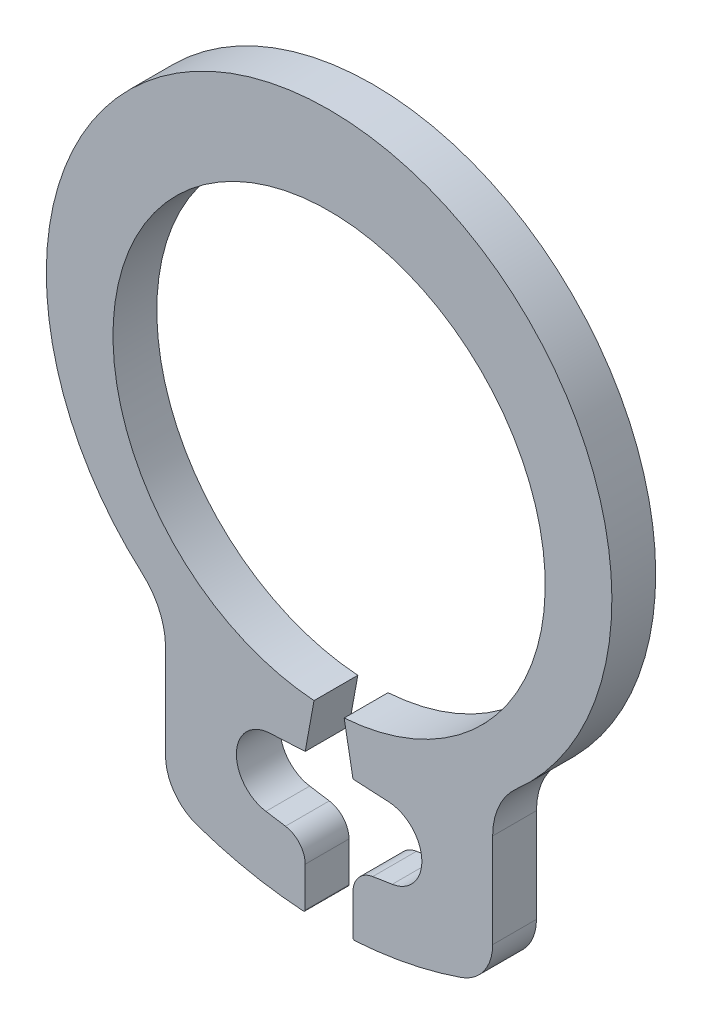
ISO-10303-21;
HEADER;
FILE_DESCRIPTION(('STEP AP214'),'2;1');
FILE_NAME('part.step','',(''),(''),'','','');
FILE_SCHEMA(('AUTOMOTIVE_DESIGN { 1 0 10303 214 1 1 1 1 }'));
ENDSEC;
DATA;
#1=APPLICATION_CONTEXT('core data for automotive mechanical design processes');
#2=APPLICATION_PROTOCOL_DEFINITION('international standard','automotive_design',2000,#1);
#3=PRODUCT_CONTEXT('',#1,'mechanical');
#4=PRODUCT('Part','Part','',(#3));
#5=PRODUCT_RELATED_PRODUCT_CATEGORY('part','',(#4));
#6=PRODUCT_DEFINITION_FORMATION('','',#4);
#7=PRODUCT_DEFINITION_CONTEXT('part definition',#1,'design');
#8=PRODUCT_DEFINITION('design','',#6,#7);
#9=PRODUCT_DEFINITION_SHAPE('','',#8);
#10=(LENGTH_UNIT() NAMED_UNIT(*) SI_UNIT(.MILLI.,.METRE.));
#11=(NAMED_UNIT(*) PLANE_ANGLE_UNIT() SI_UNIT($,.RADIAN.));
#12=(NAMED_UNIT(*) SI_UNIT($,.STERADIAN.) SOLID_ANGLE_UNIT());
#13=UNCERTAINTY_MEASURE_WITH_UNIT(LENGTH_MEASURE(1.E-05),#10,'distance_accuracy_value','');
#14=(GEOMETRIC_REPRESENTATION_CONTEXT(3) GLOBAL_UNCERTAINTY_ASSIGNED_CONTEXT((#13)) GLOBAL_UNIT_ASSIGNED_CONTEXT((#10,
#11,#12)) REPRESENTATION_CONTEXT('',''));
#15=CARTESIAN_POINT('',(0.,0.,0.));
#16=DIRECTION('',(0.,0.,1.));
#17=DIRECTION('',(1.,0.,0.));
#18=AXIS2_PLACEMENT_3D('',#15,#16,#17);
#19=CARTESIAN_POINT('',(0.,0.358532333118166,0.375));
#20=DIRECTION('',(0.,0.,-1.));
#21=DIRECTION('',(-1.,0.,0.));
#22=AXIS2_PLACEMENT_3D('',#19,#20,#21);
#23=CYLINDRICAL_SURFACE('',#22,4.84146766688184);
#24=CARTESIAN_POINT('',(0.,0.358532333118166,-0.375));
#25=DIRECTION('',(0.,0.,1.));
#26=DIRECTION('',(1.,0.,0.));
#27=AXIS2_PLACEMENT_3D('',#24,#25,#26);
#28=CIRCLE('',#27,4.84146766688184);
#29=CARTESIAN_POINT('',(3.20560494235103,-3.2696774352162,-0.375));
#30=VERTEX_POINT('',#29);
#31=CARTESIAN_POINT('',(-3.20560494235102,-3.26967743521621,-0.375));
#32=VERTEX_POINT('',#31);
#33=EDGE_CURVE('E159',#30,#32,#28,.T.);
#34=ORIENTED_EDGE('',*,*,#33,.T.);
#35=DIRECTION('',(0.,0.,-1.));
#36=VECTOR('',#35,1.);
#37=CARTESIAN_POINT('',(-3.20560494235102,-3.26967743521621,0.375));
#38=LINE('',#37,#36);
#39=CARTESIAN_POINT('',(-3.20560494235102,-3.26967743521621,0.375));
#40=VERTEX_POINT('',#39);
#41=EDGE_CURVE('E11',#40,#32,#38,.T.);
#42=ORIENTED_EDGE('',*,*,#41,.F.);
#43=CARTESIAN_POINT('',(0.,0.358532333118166,0.375));
#44=DIRECTION('',(0.,0.,1.));
#45=DIRECTION('',(1.,0.,0.));
#46=AXIS2_PLACEMENT_3D('',#43,#44,#45);
#47=CIRCLE('',#46,4.84146766688184);
#48=CARTESIAN_POINT('',(3.20560494235103,-3.2696774352162,0.375));
#49=VERTEX_POINT('',#48);
#50=EDGE_CURVE('E185',#49,#40,#47,.T.);
#51=ORIENTED_EDGE('',*,*,#50,.F.);
#52=DIRECTION('',(0.,0.,-1.));
#53=VECTOR('',#52,1.);
#54=CARTESIAN_POINT('',(3.20560494235103,-3.2696774352162,0.375));
#55=LINE('',#54,#53);
#56=EDGE_CURVE('E163',#49,#30,#55,.T.);
#57=ORIENTED_EDGE('',*,*,#56,.T.);
#58=EDGE_LOOP('',(#34,#42,#51,#57));
#59=FACE_BOUND('',#58,.T.);
#60=ADVANCED_FACE('F32',(#59),#23,.T.);
#61=CARTESIAN_POINT('',(-4.00014209420165,-4.16896088014838,0.375));
#62=DIRECTION('',(0.,0.,-1.));
#63=DIRECTION('',(-1.,0.,0.));
#64=AXIS2_PLACEMENT_3D('',#61,#62,#63);
#65=CYLINDRICAL_SURFACE('',#64,1.2);
#66=CARTESIAN_POINT('',(-4.00014209420165,-4.16896088014838,-0.375));
#67=DIRECTION('',(0.,0.,-1.));
#68=DIRECTION('',(-1.,0.,0.));
#69=AXIS2_PLACEMENT_3D('',#66,#67,#68);
#70=CIRCLE('',#69,1.2);
#71=CARTESIAN_POINT('',(-2.80014209420166,-4.16896088014838,-0.375));
#72=VERTEX_POINT('',#71);
#73=EDGE_CURVE('E162',#32,#72,#70,.T.);
#74=ORIENTED_EDGE('',*,*,#73,.T.);
#75=DIRECTION('',(0.,0.,-1.));
#76=VECTOR('',#75,1.);
#77=CARTESIAN_POINT('',(-2.80014209420166,-4.16896088014838,0.375));
#78=LINE('',#77,#76);
#79=CARTESIAN_POINT('',(-2.80014209420166,-4.16896088014838,0.375));
#80=VERTEX_POINT('',#79);
#81=EDGE_CURVE('E40',#80,#72,#78,.T.);
#82=ORIENTED_EDGE('',*,*,#81,.F.);
#83=CARTESIAN_POINT('',(-4.00014209420165,-4.16896088014838,0.375));
#84=DIRECTION('',(0.,0.,-1.));
#85=DIRECTION('',(-1.,0.,0.));
#86=AXIS2_PLACEMENT_3D('',#83,#84,#85);
#87=CIRCLE('',#86,1.2);
#88=EDGE_CURVE('E104',#40,#80,#87,.T.);
#89=ORIENTED_EDGE('',*,*,#88,.F.);
#90=ORIENTED_EDGE('',*,*,#41,.T.);
#91=EDGE_LOOP('',(#74,#82,#89,#90));
#92=FACE_BOUND('',#91,.T.);
#93=ADVANCED_FACE('F315',(#92),#65,.F.);
#94=CARTESIAN_POINT('',(-2.80014209420165,-5.78059464722595,0.375));
#95=DIRECTION('',(1.,0.,0.));
#96=DIRECTION('',(0.,1.,0.));
#97=AXIS2_PLACEMENT_3D('',#94,#95,#96);
#98=PLANE('',#97);
#99=DIRECTION('',(0.,-1.,0.));
#100=VECTOR('',#99,1.);
#101=CARTESIAN_POINT('',(-2.80014209420165,-5.78059464722595,-0.375));
#102=LINE('',#101,#100);
#103=CARTESIAN_POINT('',(-2.80014209420166,-5.78059464722595,-0.375));
#104=VERTEX_POINT('',#103);
#105=EDGE_CURVE('E165',#72,#104,#102,.T.);
#106=ORIENTED_EDGE('',*,*,#105,.T.);
#107=DIRECTION('',(0.,0.,-1.));
#108=VECTOR('',#107,1.);
#109=CARTESIAN_POINT('',(-2.80014209420166,-5.78059464722595,0.375));
#110=LINE('',#109,#108);
#111=CARTESIAN_POINT('',(-2.80014209420166,-5.78059464722595,0.375));
#112=VERTEX_POINT('',#111);
#113=EDGE_CURVE('E204',#112,#104,#110,.T.);
#114=ORIENTED_EDGE('',*,*,#113,.F.);
#115=DIRECTION('',(0.,-1.,0.));
#116=VECTOR('',#115,1.);
#117=CARTESIAN_POINT('',(-2.80014209420165,-5.78059464722595,0.375));
#118=LINE('',#117,#116);
#119=EDGE_CURVE('E212',#80,#112,#118,.T.);
#120=ORIENTED_EDGE('',*,*,#119,.F.);
#121=ORIENTED_EDGE('',*,*,#81,.T.);
#122=EDGE_LOOP('',(#106,#114,#120,#121));
#123=FACE_BOUND('',#122,.T.);
#124=ADVANCED_FACE('F210',(#123),#98,.F.);
#125=CARTESIAN_POINT('',(-2.00014209420166,-5.78059464722595,0.375));
#126=DIRECTION('',(0.,0.,-1.));
#127=DIRECTION('',(-1.,0.,0.));
#128=AXIS2_PLACEMENT_3D('',#125,#126,#127);
#129=CYLINDRICAL_SURFACE('',#128,0.799999999999999);
#130=CARTESIAN_POINT('',(-2.00014209420166,-5.78059464722595,-0.375));
#131=DIRECTION('',(0.,0.,1.));
#132=DIRECTION('',(1.,0.,0.));
#133=AXIS2_PLACEMENT_3D('',#130,#131,#132);
#134=CIRCLE('',#133,0.799999999999999);
#135=CARTESIAN_POINT('',(-2.2617332582225,-6.53661717526742,-0.375));
#136=VERTEX_POINT('',#135);
#137=EDGE_CURVE('E167',#104,#136,#134,.T.);
#138=ORIENTED_EDGE('',*,*,#137,.T.);
#139=DIRECTION('',(0.,0.,-1.));
#140=VECTOR('',#139,1.);
#141=CARTESIAN_POINT('',(-2.2617332582225,-6.53661717526742,0.375));
#142=LINE('',#141,#140);
#143=CARTESIAN_POINT('',(-2.2617332582225,-6.53661717526742,0.375));
#144=VERTEX_POINT('',#143);
#145=EDGE_CURVE('E201',#144,#136,#142,.T.);
#146=ORIENTED_EDGE('',*,*,#145,.F.);
#147=CARTESIAN_POINT('',(-2.00014209420166,-5.78059464722595,0.375));
#148=DIRECTION('',(0.,0.,1.));
#149=DIRECTION('',(1.,0.,0.));
#150=AXIS2_PLACEMENT_3D('',#147,#148,#149);
#151=CIRCLE('',#150,0.799999999999999);
#152=EDGE_CURVE('E230',#112,#144,#151,.T.);
#153=ORIENTED_EDGE('',*,*,#152,.F.);
#154=ORIENTED_EDGE('',*,*,#113,.T.);
#155=EDGE_LOOP('',(#138,#146,#153,#154));
#156=FACE_BOUND('',#155,.T.);
#157=ADVANCED_FACE('F221',(#156),#129,.T.);
#158=CARTESIAN_POINT('',(0.,0.,0.375));
#159=DIRECTION('',(0.,0.,-1.));
#160=DIRECTION('',(-1.,0.,0.));
#161=AXIS2_PLACEMENT_3D('',#158,#159,#160);
#162=CYLINDRICAL_SURFACE('',#161,6.91684909676009);
#163=CARTESIAN_POINT('',(0.,0.,-0.375));
#164=DIRECTION('',(0.,0.,1.));
#165=DIRECTION('',(1.,0.,0.));
#166=AXIS2_PLACEMENT_3D('',#163,#164,#165);
#167=CIRCLE('',#166,6.91684909676009);
#168=CARTESIAN_POINT('',(-0.443205366709181,-6.90263503527972,-0.375));
#169=VERTEX_POINT('',#168);
#170=EDGE_CURVE('E169',#136,#169,#167,.T.);
#171=ORIENTED_EDGE('',*,*,#170,.T.);
#172=DIRECTION('',(0.,0.,-1.));
#173=VECTOR('',#172,1.);
#174=CARTESIAN_POINT('',(-0.443205366709181,-6.90263503527972,0.375));
#175=LINE('',#174,#173);
#176=CARTESIAN_POINT('',(-0.443205366709181,-6.90263503527972,0.375));
#177=VERTEX_POINT('',#176);
#178=EDGE_CURVE('E198',#177,#169,#175,.T.);
#179=ORIENTED_EDGE('',*,*,#178,.F.);
#180=CARTESIAN_POINT('',(0.,0.,0.375));
#181=DIRECTION('',(0.,0.,1.));
#182=DIRECTION('',(1.,0.,0.));
#183=AXIS2_PLACEMENT_3D('',#180,#181,#182);
#184=CIRCLE('',#183,6.91684909676009);
#185=EDGE_CURVE('E227',#144,#177,#184,.T.);
#186=ORIENTED_EDGE('',*,*,#185,.F.);
#187=ORIENTED_EDGE('',*,*,#145,.T.);
#188=EDGE_LOOP('',(#171,#179,#186,#187));
#189=FACE_BOUND('',#188,.T.);
#190=ADVANCED_FACE('F225',(#189),#162,.T.);
#191=CARTESIAN_POINT('',(-0.44115492849139,-6.87070079498634,0.375));
#192=DIRECTION('',(0.,0.,-1.));
#193=DIRECTION('',(-1.,0.,0.));
#194=AXIS2_PLACEMENT_3D('',#191,#192,#193);
#195=CYLINDRICAL_SURFACE('',#194,0.0319999999999998);
#196=CARTESIAN_POINT('',(-0.44115492849139,-6.87070079498634,-0.375));
#197=DIRECTION('',(0.,0.,1.));
#198=DIRECTION('',(1.,0.,0.));
#199=AXIS2_PLACEMENT_3D('',#196,#197,#198);
#200=CIRCLE('',#199,0.0319999999999998);
#201=CARTESIAN_POINT('',(-0.40915492849139,-6.87070079498634,-0.375));
#202=VERTEX_POINT('',#201);
#203=EDGE_CURVE('E171',#169,#202,#200,.T.);
#204=ORIENTED_EDGE('',*,*,#203,.T.);
#205=DIRECTION('',(0.,0.,-1.));
#206=VECTOR('',#205,1.);
#207=CARTESIAN_POINT('',(-0.40915492849139,-6.87070079498634,0.375));
#208=LINE('',#207,#206);
#209=CARTESIAN_POINT('',(-0.40915492849139,-6.87070079498634,0.375));
#210=VERTEX_POINT('',#209);
#211=EDGE_CURVE('E195',#210,#202,#208,.T.);
#212=ORIENTED_EDGE('',*,*,#211,.F.);
#213=CARTESIAN_POINT('',(-0.44115492849139,-6.87070079498634,0.375));
#214=DIRECTION('',(0.,0.,1.));
#215=DIRECTION('',(1.,0.,0.));
#216=AXIS2_PLACEMENT_3D('',#213,#214,#215);
#217=CIRCLE('',#216,0.0319999999999998);
#218=EDGE_CURVE('E229',#177,#210,#217,.T.);
#219=ORIENTED_EDGE('',*,*,#218,.F.);
#220=ORIENTED_EDGE('',*,*,#178,.T.);
#221=EDGE_LOOP('',(#204,#212,#219,#220));
#222=FACE_BOUND('',#221,.T.);
#223=ADVANCED_FACE('F327',(#222),#195,.T.);
#224=CARTESIAN_POINT('',(-0.40915492849139,-6.87070079498634,0.375));
#225=DIRECTION('',(-1.,0.,0.));
#226=DIRECTION('',(0.,0.,1.));
#227=AXIS2_PLACEMENT_3D('',#224,#225,#226);
#228=PLANE('',#227);
#229=DIRECTION('',(0.,1.,0.));
#230=VECTOR('',#229,1.);
#231=CARTESIAN_POINT('',(-0.40915492849139,-6.87070079498634,-0.375));
#232=LINE('',#231,#230);
#233=CARTESIAN_POINT('',(-0.40915492849139,-6.19282035382956,-0.375));
#234=VERTEX_POINT('',#233);
#235=EDGE_CURVE('E173',#202,#234,#232,.T.);
#236=ORIENTED_EDGE('',*,*,#235,.T.);
#237=DIRECTION('',(0.,0.,-1.));
#238=VECTOR('',#237,1.);
#239=CARTESIAN_POINT('',(-0.40915492849139,-6.19282035382956,0.375));
#240=LINE('',#239,#238);
#241=CARTESIAN_POINT('',(-0.40915492849139,-6.19282035382956,0.375));
#242=VERTEX_POINT('',#241);
#243=EDGE_CURVE('E192',#242,#234,#240,.T.);
#244=ORIENTED_EDGE('',*,*,#243,.F.);
#245=DIRECTION('',(0.,1.,0.));
#246=VECTOR('',#245,1.);
#247=CARTESIAN_POINT('',(-0.40915492849139,-6.87070079498634,0.375));
#248=LINE('',#247,#246);
#249=EDGE_CURVE('E232',#210,#242,#248,.T.);
#250=ORIENTED_EDGE('',*,*,#249,.F.);
#251=ORIENTED_EDGE('',*,*,#211,.T.);
#252=EDGE_LOOP('',(#236,#244,#250,#251));
#253=FACE_BOUND('',#252,.T.);
#254=ADVANCED_FACE('F330',(#253),#228,.F.);
#255=CARTESIAN_POINT('',(-0.80915492849139,-6.19282035382956,0.375));
#256=DIRECTION('',(0.,0.,-1.));
#257=DIRECTION('',(-1.,0.,0.));
#258=AXIS2_PLACEMENT_3D('',#255,#256,#257);
#259=CYLINDRICAL_SURFACE('',#258,0.4);
#260=CARTESIAN_POINT('',(-0.80915492849139,-6.19282035382956,-0.375));
#261=DIRECTION('',(0.,0.,1.));
#262=DIRECTION('',(-1.,0.,0.));
#263=AXIS2_PLACEMENT_3D('',#260,#261,#262);
#264=CIRCLE('',#263,0.4);
#265=CARTESIAN_POINT('',(-0.746581142475295,-5.7977450175915,-0.375));
#266=VERTEX_POINT('',#265);
#267=EDGE_CURVE('E175',#234,#266,#264,.T.);
#268=ORIENTED_EDGE('',*,*,#267,.T.);
#269=DIRECTION('',(0.,0.,-1.));
#270=VECTOR('',#269,1.);
#271=CARTESIAN_POINT('',(-0.746581142475295,-5.7977450175915,0.375));
#272=LINE('',#271,#270);
#273=CARTESIAN_POINT('',(-0.746581142475295,-5.7977450175915,0.375));
#274=VERTEX_POINT('',#273);
#275=EDGE_CURVE('E189',#274,#266,#272,.T.);
#276=ORIENTED_EDGE('',*,*,#275,.F.);
#277=CARTESIAN_POINT('',(-0.80915492849139,-6.19282035382956,0.375));
#278=DIRECTION('',(0.,0.,1.));
#279=DIRECTION('',(-1.,0.,0.));
#280=AXIS2_PLACEMENT_3D('',#277,#278,#279);
#281=CIRCLE('',#280,0.4);
#282=EDGE_CURVE('E238',#242,#274,#281,.T.);
#283=ORIENTED_EDGE('',*,*,#282,.F.);
#284=ORIENTED_EDGE('',*,*,#243,.T.);
#285=EDGE_LOOP('',(#268,#276,#283,#284));
#286=FACE_BOUND('',#285,.T.);
#287=ADVANCED_FACE('F244',(#286),#259,.T.);
#288=CARTESIAN_POINT('',(-1.08154488683527,-5.74469197241204,0.375));
#289=DIRECTION('',(-0.156434465040234,-0.987688340595137,0.));
#290=DIRECTION('',(0.987688340595137,-0.156434465040234,0.));
#291=AXIS2_PLACEMENT_3D('',#288,#289,#290);
#292=PLANE('',#291);
#293=DIRECTION('',(-0.987688340595137,0.156434465040234,0.));
#294=VECTOR('',#293,1.);
#295=CARTESIAN_POINT('',(-1.08154488683527,-5.74469197241204,-0.375));
#296=LINE('',#295,#294);
#297=CARTESIAN_POINT('',(-1.08154488683527,-5.74469197241204,-0.375));
#298=VERTEX_POINT('',#297);
#299=EDGE_CURVE('E177',#266,#298,#296,.T.);
#300=ORIENTED_EDGE('',*,*,#299,.T.);
#301=DIRECTION('',(0.,0.,-1.));
#302=VECTOR('',#301,1.);
#303=CARTESIAN_POINT('',(-1.08154488683527,-5.74469197241204,0.375));
#304=LINE('',#303,#302);
#305=CARTESIAN_POINT('',(-1.08154488683527,-5.74469197241204,0.375));
#306=VERTEX_POINT('',#305);
#307=EDGE_CURVE('E148',#306,#298,#304,.T.);
#308=ORIENTED_EDGE('',*,*,#307,.F.);
#309=DIRECTION('',(-0.987688340595137,0.156434465040234,0.));
#310=VECTOR('',#309,1.);
#311=CARTESIAN_POINT('',(-1.08154488683527,-5.74469197241204,0.375));
#312=LINE('',#311,#310);
#313=EDGE_CURVE('E139',#274,#306,#312,.T.);
#314=ORIENTED_EDGE('',*,*,#313,.F.);
#315=ORIENTED_EDGE('',*,*,#275,.T.);
#316=EDGE_LOOP('',(#300,#308,#314,#315));
#317=FACE_BOUND('',#316,.T.);
#318=ADVANCED_FACE('F248',(#317),#292,.F.);
#319=CARTESIAN_POINT('',(-0.987684207811129,-5.15207896805495,0.375));
#320=DIRECTION('',(0.,0.,-1.));
#321=DIRECTION('',(-1.,0.,0.));
#322=AXIS2_PLACEMENT_3D('',#319,#320,#321);
#323=CYLINDRICAL_SURFACE('',#322,0.600000000000001);
#324=CARTESIAN_POINT('',(-0.987684207811129,-5.15207896805495,-0.375));
#325=DIRECTION('',(0.,0.,-1.));
#326=DIRECTION('',(1.,0.,0.));
#327=AXIS2_PLACEMENT_3D('',#324,#325,#326);
#328=CIRCLE('',#327,0.600000000000001);
#329=CARTESIAN_POINT('',(-1.01908578155689,-4.55290124720221,-0.375));
#330=VERTEX_POINT('',#329);
#331=EDGE_CURVE('E147',#298,#330,#328,.T.);
#332=ORIENTED_EDGE('',*,*,#331,.T.);
#333=DIRECTION('',(0.,0.,-1.));
#334=VECTOR('',#333,1.);
#335=CARTESIAN_POINT('',(-1.01908578155689,-4.55290124720221,0.375));
#336=LINE('',#335,#334);
#337=CARTESIAN_POINT('',(-1.01908578155689,-4.55290124720221,0.375));
#338=VERTEX_POINT('',#337);
#339=EDGE_CURVE('E144',#338,#330,#336,.T.);
#340=ORIENTED_EDGE('',*,*,#339,.F.);
#341=CARTESIAN_POINT('',(-0.987684207811129,-5.15207896805495,0.375));
#342=DIRECTION('',(0.,0.,-1.));
#343=DIRECTION('',(1.,0.,0.));
#344=AXIS2_PLACEMENT_3D('',#341,#342,#343);
#345=CIRCLE('',#344,0.600000000000001);
#346=EDGE_CURVE('E133',#306,#338,#345,.T.);
#347=ORIENTED_EDGE('',*,*,#346,.F.);
#348=ORIENTED_EDGE('',*,*,#307,.T.);
#349=EDGE_LOOP('',(#332,#340,#347,#348));
#350=FACE_BOUND('',#349,.T.);
#351=ADVANCED_FACE('F145',(#350),#323,.F.);
#352=CARTESIAN_POINT('',(-1.01908578155689,-4.55290124720221,0.375));
#353=DIRECTION('',(-0.0523359562429372,0.998629534754574,0.));
#354=DIRECTION('',(-0.998629534754574,-0.0523359562429372,0.));
#355=AXIS2_PLACEMENT_3D('',#352,#353,#354);
#356=PLANE('',#355);
#357=DIRECTION('',(0.998629534754574,0.0523359562429372,0.));
#358=VECTOR('',#357,1.);
#359=CARTESIAN_POINT('',(-1.01908578155689,-4.55290124720221,-0.375));
#360=LINE('',#359,#358);
#361=CARTESIAN_POINT('',(-0.40915492849139,-4.52093612567684,-0.375));
#362=VERTEX_POINT('',#361);
#363=EDGE_CURVE('E90',#330,#362,#360,.T.);
#364=ORIENTED_EDGE('',*,*,#363,.T.);
#365=DIRECTION('',(0.,0.,-1.));
#366=VECTOR('',#365,1.);
#367=CARTESIAN_POINT('',(-0.40915492849139,-4.52093612567684,0.375));
#368=LINE('',#367,#366);
#369=CARTESIAN_POINT('',(-0.40915492849139,-4.52093612567684,0.375));
#370=VERTEX_POINT('',#369);
#371=EDGE_CURVE('E149',#370,#362,#368,.T.);
#372=ORIENTED_EDGE('',*,*,#371,.F.);
#373=DIRECTION('',(0.998629534754574,0.0523359562429372,0.));
#374=VECTOR('',#373,1.);
#375=CARTESIAN_POINT('',(-1.01908578155689,-4.55290124720221,0.375));
#376=LINE('',#375,#374);
#377=EDGE_CURVE('E137',#338,#370,#376,.T.);
#378=ORIENTED_EDGE('',*,*,#377,.F.);
#379=ORIENTED_EDGE('',*,*,#339,.T.);
#380=EDGE_LOOP('',(#364,#372,#378,#379));
#381=FACE_BOUND('',#380,.T.);
#382=ADVANCED_FACE('F151',(#381),#356,.F.);
#383=CARTESIAN_POINT('',(-0.40915492849139,-4.52093612567684,0.375));
#384=DIRECTION('',(-0.983837319378187,0.179064594486857,0.));
#385=DIRECTION('',(-0.179064594486857,-0.983837319378188,0.));
#386=AXIS2_PLACEMENT_3D('',#383,#384,#385);
#387=PLANE('',#386);
#388=DIRECTION('',(0.179064594486857,0.983837319378187,0.));
#389=VECTOR('',#388,1.);
#390=CARTESIAN_POINT('',(-0.40915492849139,-4.52093612567684,-0.375));
#391=LINE('',#390,#389);
#392=CARTESIAN_POINT('',(-0.258098952853265,-3.69098698596135,-0.375));
#393=VERTEX_POINT('',#392);
#394=EDGE_CURVE('E96',#362,#393,#391,.T.);
#395=ORIENTED_EDGE('',*,*,#394,.T.);
#396=DIRECTION('',(0.,0.,-1.));
#397=VECTOR('',#396,1.);
#398=CARTESIAN_POINT('',(-0.258098952853265,-3.69098698596135,0.375));
#399=LINE('',#398,#397);
#400=CARTESIAN_POINT('',(-0.258098952853265,-3.69098698596135,0.375));
#401=VERTEX_POINT('',#400);
#402=EDGE_CURVE('E158',#401,#393,#399,.T.);
#403=ORIENTED_EDGE('',*,*,#402,.F.);
#404=DIRECTION('',(0.179064594486857,0.983837319378187,0.));
#405=VECTOR('',#404,1.);
#406=CARTESIAN_POINT('',(-0.40915492849139,-4.52093612567684,0.375));
#407=LINE('',#406,#405);
#408=EDGE_CURVE('E48',#370,#401,#407,.T.);
#409=ORIENTED_EDGE('',*,*,#408,.F.);
#410=ORIENTED_EDGE('',*,*,#371,.T.);
#411=EDGE_LOOP('',(#395,#403,#409,#410));
#412=FACE_BOUND('',#411,.T.);
#413=ADVANCED_FACE('F343',(#412),#387,.F.);
#414=CARTESIAN_POINT('',(0.,0.,0.375));
#415=DIRECTION('',(0.,0.,-1.));
#416=DIRECTION('',(-1.,0.,0.));
#417=AXIS2_PLACEMENT_3D('',#414,#415,#416);
#418=CYLINDRICAL_SURFACE('',#417,3.7);
#419=CARTESIAN_POINT('',(0.,0.,-0.375));
#420=DIRECTION('',(0.,0.,-1.));
#421=DIRECTION('',(1.,0.,0.));
#422=AXIS2_PLACEMENT_3D('',#419,#420,#421);
#423=CIRCLE('',#422,3.7);
#424=CARTESIAN_POINT('',(0.258098952853275,-3.69098698596135,-0.375));
#425=VERTEX_POINT('',#424);
#426=EDGE_CURVE('E182',#393,#425,#423,.T.);
#427=ORIENTED_EDGE('',*,*,#426,.T.);
#428=DIRECTION('',(0.,0.,-1.));
#429=VECTOR('',#428,1.);
#430=CARTESIAN_POINT('',(0.258098952853275,-3.69098698596135,0.375));
#431=LINE('',#430,#429);
#432=CARTESIAN_POINT('',(0.258098952853275,-3.69098698596135,0.375));
#433=VERTEX_POINT('',#432);
#434=EDGE_CURVE('E259',#433,#425,#431,.T.);
#435=ORIENTED_EDGE('',*,*,#434,.F.);
#436=CARTESIAN_POINT('',(0.,0.,0.375));
#437=DIRECTION('',(0.,0.,-1.));
#438=DIRECTION('',(1.,0.,0.));
#439=AXIS2_PLACEMENT_3D('',#436,#437,#438);
#440=CIRCLE('',#439,3.7);
#441=EDGE_CURVE('E153',#401,#433,#440,.T.);
#442=ORIENTED_EDGE('',*,*,#441,.F.);
#443=ORIENTED_EDGE('',*,*,#402,.T.);
#444=EDGE_LOOP('',(#427,#435,#442,#443));
#445=FACE_BOUND('',#444,.T.);
#446=ADVANCED_FACE('F257',(#445),#418,.F.);
#447=CARTESIAN_POINT('',(0.,0.358532333118166,0.375));
#448=DIRECTION('',(0.,0.,1.));
#449=DIRECTION('',(1.,0.,0.));
#450=AXIS2_PLACEMENT_3D('',#447,#448,#449);
#451=PLANE('',#450);
#452=ORIENTED_EDGE('',*,*,#50,.T.);
#453=ORIENTED_EDGE('',*,*,#88,.T.);
#454=ORIENTED_EDGE('',*,*,#119,.T.);
#455=ORIENTED_EDGE('',*,*,#152,.T.);
#456=ORIENTED_EDGE('',*,*,#185,.T.);
#457=ORIENTED_EDGE('',*,*,#218,.T.);
#458=ORIENTED_EDGE('',*,*,#249,.T.);
#459=ORIENTED_EDGE('',*,*,#282,.T.);
#460=ORIENTED_EDGE('',*,*,#313,.T.);
#461=ORIENTED_EDGE('',*,*,#346,.T.);
#462=ORIENTED_EDGE('',*,*,#377,.T.);
#463=ORIENTED_EDGE('',*,*,#408,.T.);
#464=ORIENTED_EDGE('',*,*,#441,.T.);
#465=DIRECTION('',(-0.17906459448686,0.983837319378187,0.));
#466=VECTOR('',#465,1.);
#467=CARTESIAN_POINT('',(0.409154928491402,-4.52093612567684,0.375));
#468=LINE('',#467,#466);
#469=CARTESIAN_POINT('',(0.409154928491402,-4.52093612567684,0.375));
#470=VERTEX_POINT('',#469);
#471=EDGE_CURVE('E268',#470,#433,#468,.T.);
#472=ORIENTED_EDGE('',*,*,#471,.F.);
#473=DIRECTION('',(-0.998629534754574,0.0523359562429345,0.));
#474=VECTOR('',#473,1.);
#475=CARTESIAN_POINT('',(1.0190857815569,-4.55290124720221,0.375));
#476=LINE('',#475,#474);
#477=CARTESIAN_POINT('',(1.0190857815569,-4.55290124720221,0.375));
#478=VERTEX_POINT('',#477);
#479=EDGE_CURVE('E273',#478,#470,#476,.T.);
#480=ORIENTED_EDGE('',*,*,#479,.F.);
#481=CARTESIAN_POINT('',(0.987684207811142,-5.15207896805495,0.375));
#482=DIRECTION('',(0.,0.,1.));
#483=DIRECTION('',(-1.,0.,0.));
#484=AXIS2_PLACEMENT_3D('',#481,#482,#483);
#485=CIRCLE('',#484,0.600000000000001);
#486=CARTESIAN_POINT('',(1.08154488683529,-5.74469197241203,0.375));
#487=VERTEX_POINT('',#486);
#488=EDGE_CURVE('E585',#487,#478,#485,.T.);
#489=ORIENTED_EDGE('',*,*,#488,.F.);
#490=DIRECTION('',(0.987688340595137,0.156434465040236,0.));
#491=VECTOR('',#490,1.);
#492=CARTESIAN_POINT('',(1.08154488683529,-5.74469197241203,0.375));
#493=LINE('',#492,#491);
#494=CARTESIAN_POINT('',(0.74658114247531,-5.7977450175915,0.375));
#495=VERTEX_POINT('',#494);
#496=EDGE_CURVE('E615',#495,#487,#493,.T.);
#497=ORIENTED_EDGE('',*,*,#496,.F.);
#498=CARTESIAN_POINT('',(0.809154928491407,-6.19282035382956,0.375));
#499=DIRECTION('',(0.,0.,-1.));
#500=DIRECTION('',(1.,0.,0.));
#501=AXIS2_PLACEMENT_3D('',#498,#499,#500);
#502=CIRCLE('',#501,0.4);
#503=CARTESIAN_POINT('',(0.409154928491407,-6.19282035382956,0.375));
#504=VERTEX_POINT('',#503);
#505=EDGE_CURVE('E618',#504,#495,#502,.T.);
#506=ORIENTED_EDGE('',*,*,#505,.F.);
#507=DIRECTION('',(0.,1.,0.));
#508=VECTOR('',#507,1.);
#509=CARTESIAN_POINT('',(0.409154928491408,-6.87070079498634,0.375));
#510=LINE('',#509,#508);
#511=CARTESIAN_POINT('',(0.409154928491408,-6.87070079498634,0.375));
#512=VERTEX_POINT('',#511);
#513=EDGE_CURVE('E621',#512,#504,#510,.T.);
#514=ORIENTED_EDGE('',*,*,#513,.F.);
#515=CARTESIAN_POINT('',(0.441154928491408,-6.87070079498634,0.375));
#516=DIRECTION('',(0.,0.,-1.));
#517=DIRECTION('',(-1.,0.,0.));
#518=AXIS2_PLACEMENT_3D('',#515,#516,#517);
#519=CIRCLE('',#518,0.0319999999999998);
#520=CARTESIAN_POINT('',(0.4432053667092,-6.90263503527972,0.375));
#521=VERTEX_POINT('',#520);
#522=EDGE_CURVE('E624',#521,#512,#519,.T.);
#523=ORIENTED_EDGE('',*,*,#522,.F.);
#524=CARTESIAN_POINT('',(0.,0.,0.375));
#525=DIRECTION('',(0.,0.,-1.));
#526=DIRECTION('',(-1.,0.,0.));
#527=AXIS2_PLACEMENT_3D('',#524,#525,#526);
#528=CIRCLE('',#527,6.91684909676009);
#529=CARTESIAN_POINT('',(2.26173325822252,-6.53661717526742,0.375));
#530=VERTEX_POINT('',#529);
#531=EDGE_CURVE('E627',#530,#521,#528,.T.);
#532=ORIENTED_EDGE('',*,*,#531,.F.);
#533=CARTESIAN_POINT('',(2.00014209420167,-5.78059464722595,0.375));
#534=DIRECTION('',(0.,0.,-1.));
#535=DIRECTION('',(-1.,0.,0.));
#536=AXIS2_PLACEMENT_3D('',#533,#534,#535);
#537=CIRCLE('',#536,0.799999999999999);
#538=CARTESIAN_POINT('',(2.80014209420167,-5.78059464722594,0.375));
#539=VERTEX_POINT('',#538);
#540=EDGE_CURVE('E630',#539,#530,#537,.T.);
#541=ORIENTED_EDGE('',*,*,#540,.F.);
#542=DIRECTION('',(0.,-1.,0.));
#543=VECTOR('',#542,1.);
#544=CARTESIAN_POINT('',(2.80014209420167,-5.78059464722594,0.375));
#545=LINE('',#544,#543);
#546=CARTESIAN_POINT('',(2.80014209420167,-4.16896088014837,0.375));
#547=VERTEX_POINT('',#546);
#548=EDGE_CURVE('E633',#547,#539,#545,.T.);
#549=ORIENTED_EDGE('',*,*,#548,.F.);
#550=CARTESIAN_POINT('',(4.00014209420167,-4.16896088014837,0.375));
#551=DIRECTION('',(0.,0.,1.));
#552=DIRECTION('',(1.,0.,0.));
#553=AXIS2_PLACEMENT_3D('',#550,#551,#552);
#554=CIRCLE('',#553,1.2);
#555=EDGE_CURVE('E312',#49,#547,#554,.T.);
#556=ORIENTED_EDGE('',*,*,#555,.F.);
#557=EDGE_LOOP('',(#452,#453,#454,#455,#456,#457,#458,#459,#460,#461,#462,#463,#464,#472,#480,
#489,#497,#506,#514,#523,#532,#541,#549,#556));
#558=FACE_BOUND('',#557,.T.);
#559=ADVANCED_FACE('F135',(#558),#451,.T.);
#560=CARTESIAN_POINT('',(0.,0.358532333118166,-0.375));
#561=DIRECTION('',(0.,0.,1.));
#562=DIRECTION('',(1.,0.,0.));
#563=AXIS2_PLACEMENT_3D('',#560,#561,#562);
#564=PLANE('',#563);
#565=ORIENTED_EDGE('',*,*,#33,.F.);
#566=CARTESIAN_POINT('',(4.00014209420167,-4.16896088014837,-0.375));
#567=DIRECTION('',(0.,0.,1.));
#568=DIRECTION('',(1.,0.,0.));
#569=AXIS2_PLACEMENT_3D('',#566,#567,#568);
#570=CIRCLE('',#569,1.2);
#571=CARTESIAN_POINT('',(2.80014209420167,-4.16896088014837,-0.375));
#572=VERTEX_POINT('',#571);
#573=EDGE_CURVE('E610',#30,#572,#570,.T.);
#574=ORIENTED_EDGE('',*,*,#573,.T.);
#575=DIRECTION('',(0.,-1.,0.));
#576=VECTOR('',#575,1.);
#577=CARTESIAN_POINT('',(2.80014209420167,-5.78059464722594,-0.375));
#578=LINE('',#577,#576);
#579=CARTESIAN_POINT('',(2.80014209420167,-5.78059464722594,-0.375));
#580=VERTEX_POINT('',#579);
#581=EDGE_CURVE('E607',#572,#580,#578,.T.);
#582=ORIENTED_EDGE('',*,*,#581,.T.);
#583=CARTESIAN_POINT('',(2.00014209420167,-5.78059464722595,-0.375));
#584=DIRECTION('',(0.,0.,-1.));
#585=DIRECTION('',(-1.,0.,0.));
#586=AXIS2_PLACEMENT_3D('',#583,#584,#585);
#587=CIRCLE('',#586,0.799999999999999);
#588=CARTESIAN_POINT('',(2.26173325822252,-6.53661717526742,-0.375));
#589=VERTEX_POINT('',#588);
#590=EDGE_CURVE('E604',#580,#589,#587,.T.);
#591=ORIENTED_EDGE('',*,*,#590,.T.);
#592=CARTESIAN_POINT('',(0.,0.,-0.375));
#593=DIRECTION('',(0.,0.,-1.));
#594=DIRECTION('',(-1.,0.,0.));
#595=AXIS2_PLACEMENT_3D('',#592,#593,#594);
#596=CIRCLE('',#595,6.91684909676009);
#597=CARTESIAN_POINT('',(0.4432053667092,-6.90263503527972,-0.375));
#598=VERTEX_POINT('',#597);
#599=EDGE_CURVE('E601',#589,#598,#596,.T.);
#600=ORIENTED_EDGE('',*,*,#599,.T.);
#601=CARTESIAN_POINT('',(0.441154928491408,-6.87070079498634,-0.375));
#602=DIRECTION('',(0.,0.,-1.));
#603=DIRECTION('',(-1.,0.,0.));
#604=AXIS2_PLACEMENT_3D('',#601,#602,#603);
#605=CIRCLE('',#604,0.0319999999999998);
#606=CARTESIAN_POINT('',(0.409154928491408,-6.87070079498634,-0.375));
#607=VERTEX_POINT('',#606);
#608=EDGE_CURVE('E598',#598,#607,#605,.T.);
#609=ORIENTED_EDGE('',*,*,#608,.T.);
#610=DIRECTION('',(0.,1.,0.));
#611=VECTOR('',#610,1.);
#612=CARTESIAN_POINT('',(0.409154928491408,-6.87070079498634,-0.375));
#613=LINE('',#612,#611);
#614=CARTESIAN_POINT('',(0.409154928491407,-6.19282035382956,-0.375));
#615=VERTEX_POINT('',#614);
#616=EDGE_CURVE('E595',#607,#615,#613,.T.);
#617=ORIENTED_EDGE('',*,*,#616,.T.);
#618=CARTESIAN_POINT('',(0.809154928491407,-6.19282035382956,-0.375));
#619=DIRECTION('',(0.,0.,-1.));
#620=DIRECTION('',(1.,0.,0.));
#621=AXIS2_PLACEMENT_3D('',#618,#619,#620);
#622=CIRCLE('',#621,0.4);
#623=CARTESIAN_POINT('',(0.74658114247531,-5.7977450175915,-0.375));
#624=VERTEX_POINT('',#623);
#625=EDGE_CURVE('E591',#615,#624,#622,.T.);
#626=ORIENTED_EDGE('',*,*,#625,.T.);
#627=DIRECTION('',(0.987688340595137,0.156434465040236,0.));
#628=VECTOR('',#627,1.);
#629=CARTESIAN_POINT('',(1.08154488683529,-5.74469197241203,-0.375));
#630=LINE('',#629,#628);
#631=CARTESIAN_POINT('',(1.08154488683529,-5.74469197241203,-0.375));
#632=VERTEX_POINT('',#631);
#633=EDGE_CURVE('E589',#624,#632,#630,.T.);
#634=ORIENTED_EDGE('',*,*,#633,.T.);
#635=CARTESIAN_POINT('',(0.987684207811142,-5.15207896805495,-0.375));
#636=DIRECTION('',(0.,0.,1.));
#637=DIRECTION('',(-1.,0.,0.));
#638=AXIS2_PLACEMENT_3D('',#635,#636,#637);
#639=CIRCLE('',#638,0.600000000000001);
#640=CARTESIAN_POINT('',(1.0190857815569,-4.55290124720221,-0.375));
#641=VERTEX_POINT('',#640);
#642=EDGE_CURVE('E581',#632,#641,#639,.T.);
#643=ORIENTED_EDGE('',*,*,#642,.T.);
#644=DIRECTION('',(-0.998629534754574,0.0523359562429345,0.));
#645=VECTOR('',#644,1.);
#646=CARTESIAN_POINT('',(1.0190857815569,-4.55290124720221,-0.375));
#647=LINE('',#646,#645);
#648=CARTESIAN_POINT('',(0.409154928491402,-4.52093612567684,-0.375));
#649=VERTEX_POINT('',#648);
#650=EDGE_CURVE('E574',#641,#649,#647,.T.);
#651=ORIENTED_EDGE('',*,*,#650,.T.);
#652=DIRECTION('',(-0.17906459448686,0.983837319378187,0.));
#653=VECTOR('',#652,1.);
#654=CARTESIAN_POINT('',(0.409154928491402,-4.52093612567684,-0.375));
#655=LINE('',#654,#653);
#656=EDGE_CURVE('E253',#649,#425,#655,.T.);
#657=ORIENTED_EDGE('',*,*,#656,.T.);
#658=ORIENTED_EDGE('',*,*,#426,.F.);
#659=ORIENTED_EDGE('',*,*,#394,.F.);
#660=ORIENTED_EDGE('',*,*,#363,.F.);
#661=ORIENTED_EDGE('',*,*,#331,.F.);
#662=ORIENTED_EDGE('',*,*,#299,.F.);
#663=ORIENTED_EDGE('',*,*,#267,.F.);
#664=ORIENTED_EDGE('',*,*,#235,.F.);
#665=ORIENTED_EDGE('',*,*,#203,.F.);
#666=ORIENTED_EDGE('',*,*,#170,.F.);
#667=ORIENTED_EDGE('',*,*,#137,.F.);
#668=ORIENTED_EDGE('',*,*,#105,.F.);
#669=ORIENTED_EDGE('',*,*,#73,.F.);
#670=EDGE_LOOP('',(#565,#574,#582,#591,#600,#609,#617,#626,#634,#643,#651,#657,#658,#659,#660,
#661,#662,#663,#664,#665,#666,#667,#668,#669));
#671=FACE_BOUND('',#670,.T.);
#672=ADVANCED_FACE('F216',(#671),#564,.F.);
#673=CARTESIAN_POINT('',(4.00014209420167,-4.16896088014837,0.375));
#674=DIRECTION('',(0.,0.,-1.));
#675=DIRECTION('',(1.,0.,0.));
#676=AXIS2_PLACEMENT_3D('',#673,#674,#675);
#677=CYLINDRICAL_SURFACE('',#676,1.2);
#678=ORIENTED_EDGE('',*,*,#573,.F.);
#679=ORIENTED_EDGE('',*,*,#56,.F.);
#680=ORIENTED_EDGE('',*,*,#555,.T.);
#681=DIRECTION('',(0.,0.,-1.));
#682=VECTOR('',#681,1.);
#683=CARTESIAN_POINT('',(2.80014209420167,-4.16896088014837,0.375));
#684=LINE('',#683,#682);
#685=EDGE_CURVE('E301',#547,#572,#684,.T.);
#686=ORIENTED_EDGE('',*,*,#685,.T.);
#687=EDGE_LOOP('',(#678,#679,#680,#686));
#688=FACE_BOUND('',#687,.T.);
#689=ADVANCED_FACE('F350',(#688),#677,.F.);
#690=CARTESIAN_POINT('',(2.80014209420167,-5.78059464722594,0.375));
#691=DIRECTION('',(-1.,0.,0.));
#692=DIRECTION('',(0.,1.,0.));
#693=AXIS2_PLACEMENT_3D('',#690,#691,#692);
#694=PLANE('',#693);
#695=ORIENTED_EDGE('',*,*,#581,.F.);
#696=ORIENTED_EDGE('',*,*,#685,.F.);
#697=ORIENTED_EDGE('',*,*,#548,.T.);
#698=DIRECTION('',(0.,0.,-1.));
#699=VECTOR('',#698,1.);
#700=CARTESIAN_POINT('',(2.80014209420167,-5.78059464722594,0.375));
#701=LINE('',#700,#699);
#702=EDGE_CURVE('E298',#539,#580,#701,.T.);
#703=ORIENTED_EDGE('',*,*,#702,.T.);
#704=EDGE_LOOP('',(#695,#696,#697,#703));
#705=FACE_BOUND('',#704,.T.);
#706=ADVANCED_FACE('F355',(#705),#694,.F.);
#707=CARTESIAN_POINT('',(2.00014209420167,-5.78059464722595,0.375));
#708=DIRECTION('',(0.,0.,-1.));
#709=DIRECTION('',(1.,0.,0.));
#710=AXIS2_PLACEMENT_3D('',#707,#708,#709);
#711=CYLINDRICAL_SURFACE('',#710,0.799999999999999);
#712=ORIENTED_EDGE('',*,*,#590,.F.);
#713=ORIENTED_EDGE('',*,*,#702,.F.);
#714=ORIENTED_EDGE('',*,*,#540,.T.);
#715=DIRECTION('',(0.,0.,-1.));
#716=VECTOR('',#715,1.);
#717=CARTESIAN_POINT('',(2.26173325822252,-6.53661717526742,0.375));
#718=LINE('',#717,#716);
#719=EDGE_CURVE('E295',#530,#589,#718,.T.);
#720=ORIENTED_EDGE('',*,*,#719,.T.);
#721=EDGE_LOOP('',(#712,#713,#714,#720));
#722=FACE_BOUND('',#721,.T.);
#723=ADVANCED_FACE('F359',(#722),#711,.T.);
#724=CARTESIAN_POINT('',(0.,0.,0.375));
#725=DIRECTION('',(0.,0.,-1.));
#726=DIRECTION('',(1.,0.,0.));
#727=AXIS2_PLACEMENT_3D('',#724,#725,#726);
#728=CYLINDRICAL_SURFACE('',#727,6.91684909676009);
#729=ORIENTED_EDGE('',*,*,#599,.F.);
#730=ORIENTED_EDGE('',*,*,#719,.F.);
#731=ORIENTED_EDGE('',*,*,#531,.T.);
#732=DIRECTION('',(0.,0.,-1.));
#733=VECTOR('',#732,1.);
#734=CARTESIAN_POINT('',(0.4432053667092,-6.90263503527972,0.375));
#735=LINE('',#734,#733);
#736=EDGE_CURVE('E292',#521,#598,#735,.T.);
#737=ORIENTED_EDGE('',*,*,#736,.T.);
#738=EDGE_LOOP('',(#729,#730,#731,#737));
#739=FACE_BOUND('',#738,.T.);
#740=ADVANCED_FACE('F363',(#739),#728,.T.);
#741=CARTESIAN_POINT('',(0.441154928491408,-6.87070079498634,0.375));
#742=DIRECTION('',(0.,0.,-1.));
#743=DIRECTION('',(1.,0.,0.));
#744=AXIS2_PLACEMENT_3D('',#741,#742,#743);
#745=CYLINDRICAL_SURFACE('',#744,0.0319999999999998);
#746=ORIENTED_EDGE('',*,*,#608,.F.);
#747=ORIENTED_EDGE('',*,*,#736,.F.);
#748=ORIENTED_EDGE('',*,*,#522,.T.);
#749=DIRECTION('',(0.,0.,-1.));
#750=VECTOR('',#749,1.);
#751=CARTESIAN_POINT('',(0.409154928491408,-6.87070079498634,0.375));
#752=LINE('',#751,#750);
#753=EDGE_CURVE('E289',#512,#607,#752,.T.);
#754=ORIENTED_EDGE('',*,*,#753,.T.);
#755=EDGE_LOOP('',(#746,#747,#748,#754));
#756=FACE_BOUND('',#755,.T.);
#757=ADVANCED_FACE('F367',(#756),#745,.T.);
#758=CARTESIAN_POINT('',(0.409154928491408,-6.87070079498634,0.375));
#759=DIRECTION('',(1.,0.,0.));
#760=DIRECTION('',(0.,0.,1.));
#761=AXIS2_PLACEMENT_3D('',#758,#759,#760);
#762=PLANE('',#761);
#763=ORIENTED_EDGE('',*,*,#616,.F.);
#764=ORIENTED_EDGE('',*,*,#753,.F.);
#765=ORIENTED_EDGE('',*,*,#513,.T.);
#766=DIRECTION('',(0.,0.,-1.));
#767=VECTOR('',#766,1.);
#768=CARTESIAN_POINT('',(0.409154928491407,-6.19282035382956,0.375));
#769=LINE('',#768,#767);
#770=EDGE_CURVE('E286',#504,#615,#769,.T.);
#771=ORIENTED_EDGE('',*,*,#770,.T.);
#772=EDGE_LOOP('',(#763,#764,#765,#771));
#773=FACE_BOUND('',#772,.T.);
#774=ADVANCED_FACE('F371',(#773),#762,.F.);
#775=CARTESIAN_POINT('',(0.809154928491407,-6.19282035382956,0.375));
#776=DIRECTION('',(0.,0.,-1.));
#777=DIRECTION('',(1.,0.,0.));
#778=AXIS2_PLACEMENT_3D('',#775,#776,#777);
#779=CYLINDRICAL_SURFACE('',#778,0.4);
#780=ORIENTED_EDGE('',*,*,#625,.F.);
#781=ORIENTED_EDGE('',*,*,#770,.F.);
#782=ORIENTED_EDGE('',*,*,#505,.T.);
#783=DIRECTION('',(0.,0.,-1.));
#784=VECTOR('',#783,1.);
#785=CARTESIAN_POINT('',(0.74658114247531,-5.7977450175915,0.375));
#786=LINE('',#785,#784);
#787=EDGE_CURVE('E283',#495,#624,#786,.T.);
#788=ORIENTED_EDGE('',*,*,#787,.T.);
#789=EDGE_LOOP('',(#780,#781,#782,#788));
#790=FACE_BOUND('',#789,.T.);
#791=ADVANCED_FACE('F375',(#790),#779,.T.);
#792=CARTESIAN_POINT('',(1.08154488683529,-5.74469197241203,0.375));
#793=DIRECTION('',(0.156434465040236,-0.987688340595137,0.));
#794=DIRECTION('',(-0.987688340595137,-0.156434465040236,0.));
#795=AXIS2_PLACEMENT_3D('',#792,#793,#794);
#796=PLANE('',#795);
#797=ORIENTED_EDGE('',*,*,#633,.F.);
#798=ORIENTED_EDGE('',*,*,#787,.F.);
#799=ORIENTED_EDGE('',*,*,#496,.T.);
#800=DIRECTION('',(0.,0.,-1.));
#801=VECTOR('',#800,1.);
#802=CARTESIAN_POINT('',(1.08154488683529,-5.74469197241203,0.375));
#803=LINE('',#802,#801);
#804=EDGE_CURVE('E280',#487,#632,#803,.T.);
#805=ORIENTED_EDGE('',*,*,#804,.T.);
#806=EDGE_LOOP('',(#797,#798,#799,#805));
#807=FACE_BOUND('',#806,.T.);
#808=ADVANCED_FACE('F379',(#807),#796,.F.);
#809=CARTESIAN_POINT('',(0.987684207811142,-5.15207896805495,0.375));
#810=DIRECTION('',(0.,0.,-1.));
#811=DIRECTION('',(1.,0.,0.));
#812=AXIS2_PLACEMENT_3D('',#809,#810,#811);
#813=CYLINDRICAL_SURFACE('',#812,0.600000000000001);
#814=ORIENTED_EDGE('',*,*,#642,.F.);
#815=ORIENTED_EDGE('',*,*,#804,.F.);
#816=ORIENTED_EDGE('',*,*,#488,.T.);
#817=DIRECTION('',(0.,0.,-1.));
#818=VECTOR('',#817,1.);
#819=CARTESIAN_POINT('',(1.0190857815569,-4.55290124720221,0.375));
#820=LINE('',#819,#818);
#821=EDGE_CURVE('E271',#478,#641,#820,.T.);
#822=ORIENTED_EDGE('',*,*,#821,.T.);
#823=EDGE_LOOP('',(#814,#815,#816,#822));
#824=FACE_BOUND('',#823,.T.);
#825=ADVANCED_FACE('F383',(#824),#813,.F.);
#826=CARTESIAN_POINT('',(1.0190857815569,-4.55290124720221,0.375));
#827=DIRECTION('',(0.0523359562429345,0.998629534754574,0.));
#828=DIRECTION('',(0.998629534754574,-0.0523359562429345,0.));
#829=AXIS2_PLACEMENT_3D('',#826,#827,#828);
#830=PLANE('',#829);
#831=ORIENTED_EDGE('',*,*,#650,.F.);
#832=ORIENTED_EDGE('',*,*,#821,.F.);
#833=ORIENTED_EDGE('',*,*,#479,.T.);
#834=DIRECTION('',(0.,0.,-1.));
#835=VECTOR('',#834,1.);
#836=CARTESIAN_POINT('',(0.409154928491402,-4.52093612567684,0.375));
#837=LINE('',#836,#835);
#838=EDGE_CURVE('E269',#470,#649,#837,.T.);
#839=ORIENTED_EDGE('',*,*,#838,.T.);
#840=EDGE_LOOP('',(#831,#832,#833,#839));
#841=FACE_BOUND('',#840,.T.);
#842=ADVANCED_FACE('F387',(#841),#830,.F.);
#843=CARTESIAN_POINT('',(0.409154928491402,-4.52093612567684,0.375));
#844=DIRECTION('',(0.983837319378187,0.17906459448686,0.));
#845=DIRECTION('',(0.17906459448686,-0.983837319378187,0.));
#846=AXIS2_PLACEMENT_3D('',#843,#844,#845);
#847=PLANE('',#846);
#848=ORIENTED_EDGE('',*,*,#656,.F.);
#849=ORIENTED_EDGE('',*,*,#838,.F.);
#850=ORIENTED_EDGE('',*,*,#471,.T.);
#851=ORIENTED_EDGE('',*,*,#434,.T.);
#852=EDGE_LOOP('',(#848,#849,#850,#851));
#853=FACE_BOUND('',#852,.T.);
#854=ADVANCED_FACE('F264',(#853),#847,.F.);
#855=CLOSED_SHELL('',(#60,#93,#124,#157,#190,#223,#254,#287,#318,#351,#382,#413,#446,#559,#672,
#689,#706,#723,#740,#757,#774,#791,#808,#825,#842,#854));
#856=MANIFOLD_SOLID_BREP('B2',#855);
#857=ADVANCED_BREP_SHAPE_REPRESENTATION('',(#18,#856),#14);
#858=SHAPE_DEFINITION_REPRESENTATION(#9,#857);
ENDSEC;
END-ISO-10303-21;
